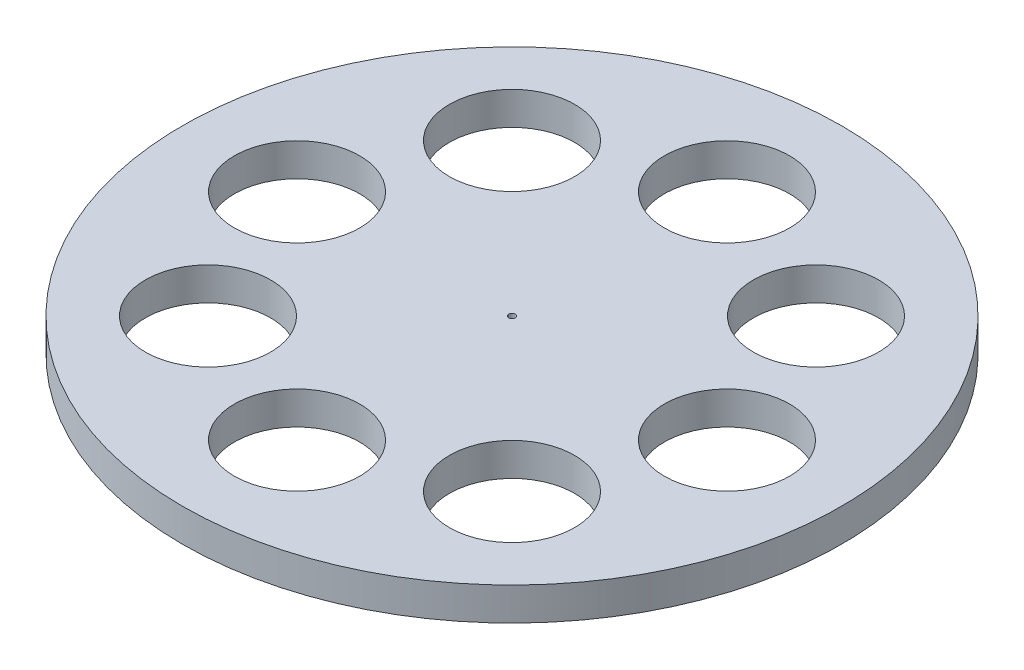
ISO-10303-21;
HEADER;
FILE_DESCRIPTION(('STEP AP214'),'2;1');
FILE_NAME('part.step','',(''),(''),'','','');
FILE_SCHEMA(('AUTOMOTIVE_DESIGN { 1 0 10303 214 1 1 1 1 }'));
ENDSEC;
DATA;
#1=APPLICATION_CONTEXT('core data for automotive mechanical design processes');
#2=APPLICATION_PROTOCOL_DEFINITION('international standard','automotive_design',2000,#1);
#3=PRODUCT_CONTEXT('',#1,'mechanical');
#4=PRODUCT('Part','Part','',(#3));
#5=PRODUCT_RELATED_PRODUCT_CATEGORY('part','',(#4));
#6=PRODUCT_DEFINITION_FORMATION('','',#4);
#7=PRODUCT_DEFINITION_CONTEXT('part definition',#1,'design');
#8=PRODUCT_DEFINITION('design','',#6,#7);
#9=PRODUCT_DEFINITION_SHAPE('','',#8);
#10=(LENGTH_UNIT() NAMED_UNIT(*) SI_UNIT(.MILLI.,.METRE.));
#11=(NAMED_UNIT(*) PLANE_ANGLE_UNIT() SI_UNIT($,.RADIAN.));
#12=(NAMED_UNIT(*) SI_UNIT($,.STERADIAN.) SOLID_ANGLE_UNIT());
#13=UNCERTAINTY_MEASURE_WITH_UNIT(LENGTH_MEASURE(1.E-05),#10,'distance_accuracy_value','');
#14=(GEOMETRIC_REPRESENTATION_CONTEXT(3) GLOBAL_UNCERTAINTY_ASSIGNED_CONTEXT((#13)) GLOBAL_UNIT_ASSIGNED_CONTEXT((#10,
#11,#12)) REPRESENTATION_CONTEXT('',''));
#15=CARTESIAN_POINT('',(0.,0.,0.));
#16=DIRECTION('',(0.,0.,1.));
#17=DIRECTION('',(1.,0.,0.));
#18=AXIS2_PLACEMENT_3D('',#15,#16,#17);
#19=CARTESIAN_POINT('',(0.,5.,0.));
#20=DIRECTION('',(0.,-1.,0.));
#21=DIRECTION('',(0.,0.,-1.));
#22=AXIS2_PLACEMENT_3D('',#19,#20,#21);
#23=CYLINDRICAL_SURFACE('',#22,50.);
#24=CARTESIAN_POINT('',(0.,5.,0.));
#25=DIRECTION('',(0.,1.,0.));
#26=DIRECTION('',(0.,0.,1.));
#27=AXIS2_PLACEMENT_3D('',#24,#25,#26);
#28=CIRCLE('',#27,50.);
#29=CARTESIAN_POINT('',(0.,5.,50.));
#30=VERTEX_POINT('',#29);
#31=EDGE_CURVE('E10',#30,#30,#28,.T.);
#32=ORIENTED_EDGE('',*,*,#31,.F.);
#33=EDGE_LOOP('',(#32));
#34=FACE_BOUND('',#33,.T.);
#35=CARTESIAN_POINT('',(0.,0.,0.));
#36=DIRECTION('',(0.,1.,0.));
#37=DIRECTION('',(0.,0.,1.));
#38=AXIS2_PLACEMENT_3D('',#35,#36,#37);
#39=CIRCLE('',#38,50.);
#40=CARTESIAN_POINT('',(0.,0.,50.));
#41=VERTEX_POINT('',#40);
#42=EDGE_CURVE('E34',#41,#41,#39,.T.);
#43=ORIENTED_EDGE('',*,*,#42,.T.);
#44=EDGE_LOOP('',(#43));
#45=FACE_BOUND('',#44,.T.);
#46=ADVANCED_FACE('F31',(#34,#45),#23,.T.);
#47=CARTESIAN_POINT('',(0.,5.,0.));
#48=DIRECTION('',(0.,1.,0.));
#49=DIRECTION('',(0.,0.,1.));
#50=AXIS2_PLACEMENT_3D('',#47,#48,#49);
#51=PLANE('',#50);
#52=CARTESIAN_POINT('',(23.0616948348797,5.,23.0616948348705));
#53=DIRECTION('',(0.,1.,0.));
#54=DIRECTION('',(0.,0.,1.));
#55=AXIS2_PLACEMENT_3D('',#52,#53,#54);
#56=CIRCLE('',#55,9.5);
#57=CARTESIAN_POINT('',(23.0616948348797,5.,32.5616948348705));
#58=VERTEX_POINT('',#57);
#59=EDGE_CURVE('E61',#58,#58,#56,.T.);
#60=ORIENTED_EDGE('',*,*,#59,.F.);
#61=EDGE_LOOP('',(#60));
#62=FACE_BOUND('',#61,.T.);
#63=CARTESIAN_POINT('',(32.614161606791,5.,-3.83066144864123E-12));
#64=DIRECTION('',(0.,1.,0.));
#65=DIRECTION('',(0.,0.,1.));
#66=AXIS2_PLACEMENT_3D('',#63,#64,#65);
#67=CIRCLE('',#66,9.5);
#68=CARTESIAN_POINT('',(32.614161606791,5.,9.49999999999617));
#69=VERTEX_POINT('',#68);
#70=EDGE_CURVE('E68',#69,#69,#67,.T.);
#71=ORIENTED_EDGE('',*,*,#70,.F.);
#72=EDGE_LOOP('',(#71));
#73=FACE_BOUND('',#72,.T.);
#74=CARTESIAN_POINT('',(23.0616948348743,5.,-23.0616948348759));
#75=DIRECTION('',(0.,1.,0.));
#76=DIRECTION('',(0.,0.,1.));
#77=AXIS2_PLACEMENT_3D('',#74,#75,#76);
#78=CIRCLE('',#77,9.5);
#79=CARTESIAN_POINT('',(23.0616948348743,5.,-13.5616948348759));
#80=VERTEX_POINT('',#79);
#81=EDGE_CURVE('E49',#80,#80,#78,.T.);
#82=ORIENTED_EDGE('',*,*,#81,.F.);
#83=EDGE_LOOP('',(#82));
#84=FACE_BOUND('',#83,.T.);
#85=CARTESIAN_POINT('',(0.,5.,0.));
#86=DIRECTION('',(0.,1.,0.));
#87=DIRECTION('',(0.,0.,1.));
#88=AXIS2_PLACEMENT_3D('',#85,#86,#87);
#89=CIRCLE('',#88,0.5);
#90=CARTESIAN_POINT('',(0.,5.,0.5));
#91=VERTEX_POINT('',#90);
#92=EDGE_CURVE('E56',#91,#91,#89,.T.);
#93=ORIENTED_EDGE('',*,*,#92,.F.);
#94=EDGE_LOOP('',(#93));
#95=FACE_BOUND('',#94,.T.);
#96=CARTESIAN_POINT('',(7.66132289728246E-12,5.,32.6141616067872));
#97=DIRECTION('',(0.,1.,0.));
#98=DIRECTION('',(0.,0.,1.));
#99=AXIS2_PLACEMENT_3D('',#96,#97,#98);
#100=CIRCLE('',#99,9.5);
#101=CARTESIAN_POINT('',(7.66132289728246E-12,5.,42.1141616067872));
#102=VERTEX_POINT('',#101);
#103=EDGE_CURVE('E91',#102,#102,#100,.T.);
#104=ORIENTED_EDGE('',*,*,#103,.F.);
#105=EDGE_LOOP('',(#104));
#106=FACE_BOUND('',#105,.T.);
#107=CARTESIAN_POINT('',(-23.0616948348666,5.,23.0616948348759));
#108=DIRECTION('',(0.,1.,0.));
#109=DIRECTION('',(0.,0.,1.));
#110=AXIS2_PLACEMENT_3D('',#107,#108,#109);
#111=CIRCLE('',#110,9.5);
#112=CARTESIAN_POINT('',(-23.0616948348666,5.,32.5616948348759));
#113=VERTEX_POINT('',#112);
#114=EDGE_CURVE('E85',#113,#113,#111,.T.);
#115=ORIENTED_EDGE('',*,*,#114,.F.);
#116=EDGE_LOOP('',(#115));
#117=FACE_BOUND('',#116,.T.);
#118=CARTESIAN_POINT('',(-32.6141616067834,5.,3.83465553150309E-12));
#119=DIRECTION('',(0.,1.,0.));
#120=DIRECTION('',(0.,0.,1.));
#121=AXIS2_PLACEMENT_3D('',#118,#119,#120);
#122=CIRCLE('',#121,9.5);
#123=CARTESIAN_POINT('',(-32.6141616067834,5.,9.50000000000384));
#124=VERTEX_POINT('',#123);
#125=EDGE_CURVE('E79',#124,#124,#122,.T.);
#126=ORIENTED_EDGE('',*,*,#125,.F.);
#127=EDGE_LOOP('',(#126));
#128=FACE_BOUND('',#127,.T.);
#129=CARTESIAN_POINT('',(-23.0616948348721,5.,-23.0616948348705));
#130=DIRECTION('',(0.,1.,0.));
#131=DIRECTION('',(0.,0.,1.));
#132=AXIS2_PLACEMENT_3D('',#129,#130,#131);
#133=CIRCLE('',#132,9.5);
#134=CARTESIAN_POINT('',(-23.0616948348721,5.,-13.5616948348705));
#135=VERTEX_POINT('',#134);
#136=EDGE_CURVE('E73',#135,#135,#133,.T.);
#137=ORIENTED_EDGE('',*,*,#136,.F.);
#138=EDGE_LOOP('',(#137));
#139=FACE_BOUND('',#138,.T.);
#140=CARTESIAN_POINT('',(0.,5.,-32.6141616067872));
#141=DIRECTION('',(0.,1.,0.));
#142=DIRECTION('',(0.,0.,1.));
#143=AXIS2_PLACEMENT_3D('',#140,#141,#142);
#144=CIRCLE('',#143,9.5);
#145=CARTESIAN_POINT('',(0.,5.,-23.1141616067872));
#146=VERTEX_POINT('',#145);
#147=EDGE_CURVE('E43',#146,#146,#144,.T.);
#148=ORIENTED_EDGE('',*,*,#147,.F.);
#149=EDGE_LOOP('',(#148));
#150=FACE_BOUND('',#149,.T.);
#151=ORIENTED_EDGE('',*,*,#31,.T.);
#152=EDGE_LOOP('',(#151));
#153=FACE_BOUND('',#152,.T.);
#154=ADVANCED_FACE('F108',(#62,#73,#84,#95,#106,#117,#128,#139,#150,#153),#51,.T.);
#155=CARTESIAN_POINT('',(0.,0.,0.));
#156=DIRECTION('',(0.,1.,0.));
#157=DIRECTION('',(0.,0.,1.));
#158=AXIS2_PLACEMENT_3D('',#155,#156,#157);
#159=PLANE('',#158);
#160=CARTESIAN_POINT('',(23.0616948348797,0.,23.0616948348705));
#161=DIRECTION('',(0.,1.,0.));
#162=DIRECTION('',(0.,0.,1.));
#163=AXIS2_PLACEMENT_3D('',#160,#161,#162);
#164=CIRCLE('',#163,9.5);
#165=CARTESIAN_POINT('',(23.0616948348797,0.,32.5616948348705));
#166=VERTEX_POINT('',#165);
#167=EDGE_CURVE('E64',#166,#166,#164,.T.);
#168=ORIENTED_EDGE('',*,*,#167,.T.);
#169=EDGE_LOOP('',(#168));
#170=FACE_BOUND('',#169,.T.);
#171=CARTESIAN_POINT('',(32.614161606791,0.,-3.83066144864123E-12));
#172=DIRECTION('',(0.,1.,0.));
#173=DIRECTION('',(0.,0.,1.));
#174=AXIS2_PLACEMENT_3D('',#171,#172,#173);
#175=CIRCLE('',#174,9.5);
#176=CARTESIAN_POINT('',(32.614161606791,0.,9.49999999999617));
#177=VERTEX_POINT('',#176);
#178=EDGE_CURVE('E53',#177,#177,#175,.T.);
#179=ORIENTED_EDGE('',*,*,#178,.T.);
#180=EDGE_LOOP('',(#179));
#181=FACE_BOUND('',#180,.T.);
#182=CARTESIAN_POINT('',(23.0616948348743,0.,-23.0616948348759));
#183=DIRECTION('',(0.,1.,0.));
#184=DIRECTION('',(0.,0.,1.));
#185=AXIS2_PLACEMENT_3D('',#182,#183,#184);
#186=CIRCLE('',#185,9.5);
#187=CARTESIAN_POINT('',(23.0616948348743,0.,-13.5616948348759));
#188=VERTEX_POINT('',#187);
#189=EDGE_CURVE('E52',#188,#188,#186,.T.);
#190=ORIENTED_EDGE('',*,*,#189,.T.);
#191=EDGE_LOOP('',(#190));
#192=FACE_BOUND('',#191,.T.);
#193=CARTESIAN_POINT('',(0.,0.,0.));
#194=DIRECTION('',(0.,1.,0.));
#195=DIRECTION('',(0.,0.,1.));
#196=AXIS2_PLACEMENT_3D('',#193,#194,#195);
#197=CIRCLE('',#196,0.5);
#198=CARTESIAN_POINT('',(0.,0.,0.5));
#199=VERTEX_POINT('',#198);
#200=EDGE_CURVE('E46',#199,#199,#197,.T.);
#201=ORIENTED_EDGE('',*,*,#200,.T.);
#202=EDGE_LOOP('',(#201));
#203=FACE_BOUND('',#202,.T.);
#204=CARTESIAN_POINT('',(7.66132289728246E-12,0.,32.6141616067872));
#205=DIRECTION('',(0.,1.,0.));
#206=DIRECTION('',(0.,0.,1.));
#207=AXIS2_PLACEMENT_3D('',#204,#205,#206);
#208=CIRCLE('',#207,9.5);
#209=CARTESIAN_POINT('',(7.66132289728246E-12,0.,42.1141616067872));
#210=VERTEX_POINT('',#209);
#211=EDGE_CURVE('E65',#210,#210,#208,.T.);
#212=ORIENTED_EDGE('',*,*,#211,.T.);
#213=EDGE_LOOP('',(#212));
#214=FACE_BOUND('',#213,.T.);
#215=CARTESIAN_POINT('',(-23.0616948348666,0.,23.0616948348759));
#216=DIRECTION('',(0.,1.,0.));
#217=DIRECTION('',(0.,0.,1.));
#218=AXIS2_PLACEMENT_3D('',#215,#216,#217);
#219=CIRCLE('',#218,9.5);
#220=CARTESIAN_POINT('',(-23.0616948348666,0.,32.5616948348759));
#221=VERTEX_POINT('',#220);
#222=EDGE_CURVE('E88',#221,#221,#219,.T.);
#223=ORIENTED_EDGE('',*,*,#222,.T.);
#224=EDGE_LOOP('',(#223));
#225=FACE_BOUND('',#224,.T.);
#226=CARTESIAN_POINT('',(-32.6141616067834,0.,3.83465553150309E-12));
#227=DIRECTION('',(0.,1.,0.));
#228=DIRECTION('',(0.,0.,1.));
#229=AXIS2_PLACEMENT_3D('',#226,#227,#228);
#230=CIRCLE('',#229,9.5);
#231=CARTESIAN_POINT('',(-32.6141616067834,0.,9.50000000000384));
#232=VERTEX_POINT('',#231);
#233=EDGE_CURVE('E82',#232,#232,#230,.T.);
#234=ORIENTED_EDGE('',*,*,#233,.T.);
#235=EDGE_LOOP('',(#234));
#236=FACE_BOUND('',#235,.T.);
#237=CARTESIAN_POINT('',(-23.0616948348721,0.,-23.0616948348705));
#238=DIRECTION('',(0.,1.,0.));
#239=DIRECTION('',(0.,0.,1.));
#240=AXIS2_PLACEMENT_3D('',#237,#238,#239);
#241=CIRCLE('',#240,9.5);
#242=CARTESIAN_POINT('',(-23.0616948348721,0.,-13.5616948348705));
#243=VERTEX_POINT('',#242);
#244=EDGE_CURVE('E76',#243,#243,#241,.T.);
#245=ORIENTED_EDGE('',*,*,#244,.T.);
#246=EDGE_LOOP('',(#245));
#247=FACE_BOUND('',#246,.T.);
#248=CARTESIAN_POINT('',(0.,0.,-32.6141616067872));
#249=DIRECTION('',(0.,1.,0.));
#250=DIRECTION('',(0.,0.,1.));
#251=AXIS2_PLACEMENT_3D('',#248,#249,#250);
#252=CIRCLE('',#251,9.5);
#253=CARTESIAN_POINT('',(0.,0.,-23.1141616067872));
#254=VERTEX_POINT('',#253);
#255=EDGE_CURVE('E41',#254,#254,#252,.T.);
#256=ORIENTED_EDGE('',*,*,#255,.T.);
#257=EDGE_LOOP('',(#256));
#258=FACE_BOUND('',#257,.T.);
#259=ORIENTED_EDGE('',*,*,#42,.F.);
#260=EDGE_LOOP('',(#259));
#261=FACE_BOUND('',#260,.T.);
#262=ADVANCED_FACE('F97',(#170,#181,#192,#203,#214,#225,#236,#247,#258,#261),#159,.F.);
#263=CARTESIAN_POINT('',(0.,0.,-32.6141616067872));
#264=DIRECTION('',(0.,1.,0.));
#265=DIRECTION('',(0.,0.,1.));
#266=AXIS2_PLACEMENT_3D('',#263,#264,#265);
#267=CYLINDRICAL_SURFACE('',#266,9.5);
#268=ORIENTED_EDGE('',*,*,#255,.F.);
#269=EDGE_LOOP('',(#268));
#270=FACE_BOUND('',#269,.T.);
#271=ORIENTED_EDGE('',*,*,#147,.T.);
#272=EDGE_LOOP('',(#271));
#273=FACE_BOUND('',#272,.T.);
#274=ADVANCED_FACE('F121',(#270,#273),#267,.F.);
#275=CARTESIAN_POINT('',(-23.0616948348721,0.,-23.0616948348705));
#276=DIRECTION('',(0.,1.,0.));
#277=DIRECTION('',(0.,0.,1.));
#278=AXIS2_PLACEMENT_3D('',#275,#276,#277);
#279=CYLINDRICAL_SURFACE('',#278,9.5);
#280=ORIENTED_EDGE('',*,*,#244,.F.);
#281=EDGE_LOOP('',(#280));
#282=FACE_BOUND('',#281,.T.);
#283=ORIENTED_EDGE('',*,*,#136,.T.);
#284=EDGE_LOOP('',(#283));
#285=FACE_BOUND('',#284,.T.);
#286=ADVANCED_FACE('F123',(#282,#285),#279,.F.);
#287=CARTESIAN_POINT('',(-32.6141616067834,0.,3.83465553150309E-12));
#288=DIRECTION('',(0.,1.,0.));
#289=DIRECTION('',(0.,0.,1.));
#290=AXIS2_PLACEMENT_3D('',#287,#288,#289);
#291=CYLINDRICAL_SURFACE('',#290,9.5);
#292=ORIENTED_EDGE('',*,*,#233,.F.);
#293=EDGE_LOOP('',(#292));
#294=FACE_BOUND('',#293,.T.);
#295=ORIENTED_EDGE('',*,*,#125,.T.);
#296=EDGE_LOOP('',(#295));
#297=FACE_BOUND('',#296,.T.);
#298=ADVANCED_FACE('F130',(#294,#297),#291,.F.);
#299=CARTESIAN_POINT('',(-23.0616948348666,0.,23.0616948348759));
#300=DIRECTION('',(0.,1.,0.));
#301=DIRECTION('',(0.,0.,1.));
#302=AXIS2_PLACEMENT_3D('',#299,#300,#301);
#303=CYLINDRICAL_SURFACE('',#302,9.5);
#304=ORIENTED_EDGE('',*,*,#222,.F.);
#305=EDGE_LOOP('',(#304));
#306=FACE_BOUND('',#305,.T.);
#307=ORIENTED_EDGE('',*,*,#114,.T.);
#308=EDGE_LOOP('',(#307));
#309=FACE_BOUND('',#308,.T.);
#310=ADVANCED_FACE('F104',(#306,#309),#303,.F.);
#311=CARTESIAN_POINT('',(7.66132289728246E-12,0.,32.6141616067872));
#312=DIRECTION('',(0.,1.,0.));
#313=DIRECTION('',(0.,0.,1.));
#314=AXIS2_PLACEMENT_3D('',#311,#312,#313);
#315=CYLINDRICAL_SURFACE('',#314,9.5);
#316=ORIENTED_EDGE('',*,*,#211,.F.);
#317=EDGE_LOOP('',(#316));
#318=FACE_BOUND('',#317,.T.);
#319=ORIENTED_EDGE('',*,*,#103,.T.);
#320=EDGE_LOOP('',(#319));
#321=FACE_BOUND('',#320,.T.);
#322=ADVANCED_FACE('F100',(#318,#321),#315,.F.);
#323=CARTESIAN_POINT('',(0.,0.,0.));
#324=DIRECTION('',(0.,1.,0.));
#325=DIRECTION('',(0.,0.,1.));
#326=AXIS2_PLACEMENT_3D('',#323,#324,#325);
#327=CYLINDRICAL_SURFACE('',#326,0.5);
#328=ORIENTED_EDGE('',*,*,#200,.F.);
#329=EDGE_LOOP('',(#328));
#330=FACE_BOUND('',#329,.T.);
#331=ORIENTED_EDGE('',*,*,#92,.T.);
#332=EDGE_LOOP('',(#331));
#333=FACE_BOUND('',#332,.T.);
#334=ADVANCED_FACE('F103',(#330,#333),#327,.F.);
#335=CARTESIAN_POINT('',(23.0616948348743,0.,-23.0616948348759));
#336=DIRECTION('',(0.,1.,0.));
#337=DIRECTION('',(0.,0.,1.));
#338=AXIS2_PLACEMENT_3D('',#335,#336,#337);
#339=CYLINDRICAL_SURFACE('',#338,9.5);
#340=ORIENTED_EDGE('',*,*,#189,.F.);
#341=EDGE_LOOP('',(#340));
#342=FACE_BOUND('',#341,.T.);
#343=ORIENTED_EDGE('',*,*,#81,.T.);
#344=EDGE_LOOP('',(#343));
#345=FACE_BOUND('',#344,.T.);
#346=ADVANCED_FACE('F194',(#342,#345),#339,.F.);
#347=CARTESIAN_POINT('',(32.614161606791,0.,-3.83066144864123E-12));
#348=DIRECTION('',(0.,1.,0.));
#349=DIRECTION('',(0.,0.,1.));
#350=AXIS2_PLACEMENT_3D('',#347,#348,#349);
#351=CYLINDRICAL_SURFACE('',#350,9.5);
#352=ORIENTED_EDGE('',*,*,#178,.F.);
#353=EDGE_LOOP('',(#352));
#354=FACE_BOUND('',#353,.T.);
#355=ORIENTED_EDGE('',*,*,#70,.T.);
#356=EDGE_LOOP('',(#355));
#357=FACE_BOUND('',#356,.T.);
#358=ADVANCED_FACE('F204',(#354,#357),#351,.F.);
#359=CARTESIAN_POINT('',(23.0616948348797,0.,23.0616948348705));
#360=DIRECTION('',(0.,1.,0.));
#361=DIRECTION('',(0.,0.,1.));
#362=AXIS2_PLACEMENT_3D('',#359,#360,#361);
#363=CYLINDRICAL_SURFACE('',#362,9.5);
#364=ORIENTED_EDGE('',*,*,#167,.F.);
#365=EDGE_LOOP('',(#364));
#366=FACE_BOUND('',#365,.T.);
#367=ORIENTED_EDGE('',*,*,#59,.T.);
#368=EDGE_LOOP('',(#367));
#369=FACE_BOUND('',#368,.T.);
#370=ADVANCED_FACE('F213',(#366,#369),#363,.F.);
#371=CLOSED_SHELL('',(#46,#154,#262,#274,#286,#298,#310,#322,#334,#346,#358,#370));
#372=MANIFOLD_SOLID_BREP('B2',#371);
#373=ADVANCED_BREP_SHAPE_REPRESENTATION('',(#18,#372),#14);
#374=SHAPE_DEFINITION_REPRESENTATION(#9,#373);
ENDSEC;
END-ISO-10303-21;
